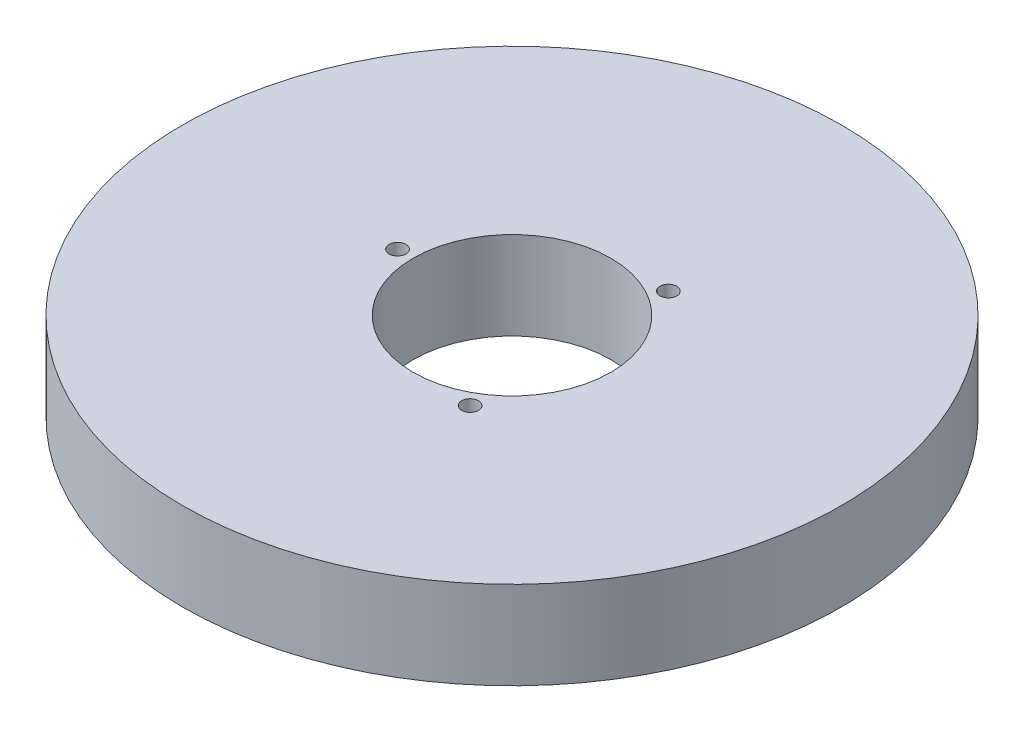
ISO-10303-21;
HEADER;
FILE_DESCRIPTION(('STEP AP214'),'2;1');
FILE_NAME('part.step','',(''),(''),'','','');
FILE_SCHEMA(('AUTOMOTIVE_DESIGN { 1 0 10303 214 1 1 1 1 }'));
ENDSEC;
DATA;
#1=APPLICATION_CONTEXT('core data for automotive mechanical design processes');
#2=APPLICATION_PROTOCOL_DEFINITION('international standard','automotive_design',2000,#1);
#3=PRODUCT_CONTEXT('',#1,'mechanical');
#4=PRODUCT('Part','Part','',(#3));
#5=PRODUCT_RELATED_PRODUCT_CATEGORY('part','',(#4));
#6=PRODUCT_DEFINITION_FORMATION('','',#4);
#7=PRODUCT_DEFINITION_CONTEXT('part definition',#1,'design');
#8=PRODUCT_DEFINITION('design','',#6,#7);
#9=PRODUCT_DEFINITION_SHAPE('','',#8);
#10=(LENGTH_UNIT() NAMED_UNIT(*) SI_UNIT(.MILLI.,.METRE.));
#11=(NAMED_UNIT(*) PLANE_ANGLE_UNIT() SI_UNIT($,.RADIAN.));
#12=(NAMED_UNIT(*) SI_UNIT($,.STERADIAN.) SOLID_ANGLE_UNIT());
#13=UNCERTAINTY_MEASURE_WITH_UNIT(LENGTH_MEASURE(1.E-05),#10,'distance_accuracy_value','');
#14=(GEOMETRIC_REPRESENTATION_CONTEXT(3) GLOBAL_UNCERTAINTY_ASSIGNED_CONTEXT((#13)) GLOBAL_UNIT_ASSIGNED_CONTEXT((#10,
#11,#12)) REPRESENTATION_CONTEXT('',''));
#15=CARTESIAN_POINT('',(0.,0.,0.));
#16=DIRECTION('',(0.,0.,1.));
#17=DIRECTION('',(1.,0.,0.));
#18=AXIS2_PLACEMENT_3D('',#15,#16,#17);
#19=CARTESIAN_POINT('',(0.,20.,0.));
#20=DIRECTION('',(0.,-1.,0.));
#21=DIRECTION('',(0.,0.,-1.));
#22=AXIS2_PLACEMENT_3D('',#19,#20,#21);
#23=CYLINDRICAL_SURFACE('',#22,75.);
#24=CARTESIAN_POINT('',(0.,20.,0.));
#25=DIRECTION('',(0.,1.,0.));
#26=DIRECTION('',(0.,0.,1.));
#27=AXIS2_PLACEMENT_3D('',#24,#25,#26);
#28=CIRCLE('',#27,75.);
#29=CARTESIAN_POINT('',(0.,20.,75.));
#30=VERTEX_POINT('',#29);
#31=EDGE_CURVE('E10',#30,#30,#28,.T.);
#32=ORIENTED_EDGE('',*,*,#31,.F.);
#33=EDGE_LOOP('',(#32));
#34=FACE_BOUND('',#33,.T.);
#35=CARTESIAN_POINT('',(0.,0.,0.));
#36=DIRECTION('',(0.,1.,0.));
#37=DIRECTION('',(0.,0.,1.));
#38=AXIS2_PLACEMENT_3D('',#35,#36,#37);
#39=CIRCLE('',#38,75.);
#40=CARTESIAN_POINT('',(0.,0.,75.));
#41=VERTEX_POINT('',#40);
#42=EDGE_CURVE('E37',#41,#41,#39,.T.);
#43=ORIENTED_EDGE('',*,*,#42,.T.);
#44=EDGE_LOOP('',(#43));
#45=FACE_BOUND('',#44,.T.);
#46=ADVANCED_FACE('F40',(#34,#45),#23,.T.);
#47=CARTESIAN_POINT('',(0.,20.,0.));
#48=DIRECTION('',(0.,1.,0.));
#49=DIRECTION('',(0.,0.,1.));
#50=AXIS2_PLACEMENT_3D('',#47,#48,#49);
#51=PLANE('',#50);
#52=CARTESIAN_POINT('',(13.0265786434046,20.,22.5626960591681));
#53=DIRECTION('',(0.,1.,0.));
#54=DIRECTION('',(0.866025403784436,0.,-0.500000000000004));
#55=AXIS2_PLACEMENT_3D('',#52,#53,#54);
#56=CIRCLE('',#55,1.90919716067538);
#57=CARTESIAN_POINT('',(14.6799918853826,20.,21.6080974788304));
#58=VERTEX_POINT('',#57);
#59=EDGE_CURVE('E70',#58,#58,#56,.T.);
#60=ORIENTED_EDGE('',*,*,#59,.F.);
#61=EDGE_LOOP('',(#60));
#62=FACE_BOUND('',#61,.T.);
#63=CARTESIAN_POINT('',(13.0265786434042,20.,-22.5626960591683));
#64=DIRECTION('',(0.,1.,0.));
#65=DIRECTION('',(-0.866025403784443,0.,-0.499999999999992));
#66=AXIS2_PLACEMENT_3D('',#63,#64,#65);
#67=CIRCLE('',#66,1.90919716067538);
#68=CARTESIAN_POINT('',(11.3731654014262,20.,-23.517294639506));
#69=VERTEX_POINT('',#68);
#70=EDGE_CURVE('E61',#69,#69,#67,.T.);
#71=ORIENTED_EDGE('',*,*,#70,.F.);
#72=EDGE_LOOP('',(#71));
#73=FACE_BOUND('',#72,.T.);
#74=CARTESIAN_POINT('',(-26.0531572868089,20.,0.));
#75=DIRECTION('',(0.,1.,0.));
#76=DIRECTION('',(0.,0.,1.));
#77=AXIS2_PLACEMENT_3D('',#74,#75,#76);
#78=CIRCLE('',#77,1.90919716067538);
#79=CARTESIAN_POINT('',(-26.0531572868089,20.,1.90919716067538));
#80=VERTEX_POINT('',#79);
#81=EDGE_CURVE('E54',#80,#80,#78,.T.);
#82=ORIENTED_EDGE('',*,*,#81,.F.);
#83=EDGE_LOOP('',(#82));
#84=FACE_BOUND('',#83,.T.);
#85=CARTESIAN_POINT('',(0.,20.,0.));
#86=DIRECTION('',(0.,1.,0.));
#87=DIRECTION('',(0.,0.,1.));
#88=AXIS2_PLACEMENT_3D('',#85,#86,#87);
#89=CIRCLE('',#88,22.5);
#90=CARTESIAN_POINT('',(0.,20.,22.5));
#91=VERTEX_POINT('',#90);
#92=EDGE_CURVE('E50',#91,#91,#89,.T.);
#93=ORIENTED_EDGE('',*,*,#92,.F.);
#94=EDGE_LOOP('',(#93));
#95=FACE_BOUND('',#94,.T.);
#96=ORIENTED_EDGE('',*,*,#31,.T.);
#97=EDGE_LOOP('',(#96));
#98=FACE_BOUND('',#97,.T.);
#99=ADVANCED_FACE('F85',(#62,#73,#84,#95,#98),#51,.T.);
#100=CARTESIAN_POINT('',(0.,0.,0.));
#101=DIRECTION('',(0.,1.,0.));
#102=DIRECTION('',(0.,0.,1.));
#103=AXIS2_PLACEMENT_3D('',#100,#101,#102);
#104=PLANE('',#103);
#105=CARTESIAN_POINT('',(0.,0.,0.));
#106=DIRECTION('',(0.,1.,0.));
#107=DIRECTION('',(0.,0.,1.));
#108=AXIS2_PLACEMENT_3D('',#105,#106,#107);
#109=CIRCLE('',#108,22.5);
#110=CARTESIAN_POINT('',(0.,0.,22.5));
#111=VERTEX_POINT('',#110);
#112=EDGE_CURVE('E47',#111,#111,#109,.T.);
#113=ORIENTED_EDGE('',*,*,#112,.T.);
#114=EDGE_LOOP('',(#113));
#115=FACE_BOUND('',#114,.T.);
#116=ORIENTED_EDGE('',*,*,#42,.F.);
#117=EDGE_LOOP('',(#116));
#118=FACE_BOUND('',#117,.T.);
#119=ADVANCED_FACE('F84',(#115,#118),#104,.F.);
#120=CARTESIAN_POINT('',(0.,20.,0.));
#121=DIRECTION('',(0.,-1.,0.));
#122=DIRECTION('',(0.,0.,-1.));
#123=AXIS2_PLACEMENT_3D('',#120,#121,#122);
#124=CYLINDRICAL_SURFACE('',#123,22.5);
#125=ORIENTED_EDGE('',*,*,#92,.T.);
#126=EDGE_LOOP('',(#125));
#127=FACE_BOUND('',#126,.T.);
#128=ORIENTED_EDGE('',*,*,#112,.F.);
#129=EDGE_LOOP('',(#128));
#130=FACE_BOUND('',#129,.T.);
#131=ADVANCED_FACE('F91',(#127,#130),#124,.F.);
#132=CARTESIAN_POINT('',(-26.0531572868089,1.8096753145772,0.));
#133=DIRECTION('',(0.,1.,0.));
#134=DIRECTION('',(0.,0.,1.));
#135=AXIS2_PLACEMENT_3D('',#132,#133,#134);
#136=CYLINDRICAL_SURFACE('',#135,1.90919716067538);
#137=CARTESIAN_POINT('',(-26.0531572868089,1.8096753145772,0.));
#138=DIRECTION('',(0.,1.,0.));
#139=DIRECTION('',(0.,0.,1.));
#140=AXIS2_PLACEMENT_3D('',#137,#138,#139);
#141=CIRCLE('',#140,1.90919716067538);
#142=CARTESIAN_POINT('',(-26.0531572868089,1.8096753145772,1.90919716067538));
#143=VERTEX_POINT('',#142);
#144=EDGE_CURVE('E55',#143,#143,#141,.T.);
#145=ORIENTED_EDGE('',*,*,#144,.F.);
#146=EDGE_LOOP('',(#145));
#147=FACE_BOUND('',#146,.T.);
#148=ORIENTED_EDGE('',*,*,#81,.T.);
#149=EDGE_LOOP('',(#148));
#150=FACE_BOUND('',#149,.T.);
#151=ADVANCED_FACE('F96',(#147,#150),#136,.F.);
#152=CARTESIAN_POINT('',(-26.0531572868089,1.8096753145772,0.));
#153=DIRECTION('',(0.,1.,0.));
#154=DIRECTION('',(0.,0.,1.));
#155=AXIS2_PLACEMENT_3D('',#152,#153,#154);
#156=PLANE('',#155);
#157=ORIENTED_EDGE('',*,*,#144,.T.);
#158=EDGE_LOOP('',(#157));
#159=FACE_BOUND('',#158,.T.);
#160=ADVANCED_FACE('F127',(#159),#156,.T.);
#161=CARTESIAN_POINT('',(13.0265786434042,1.8096753145772,-22.5626960591683));
#162=DIRECTION('',(0.,1.,0.));
#163=DIRECTION('',(0.,0.,1.));
#164=AXIS2_PLACEMENT_3D('',#161,#162,#163);
#165=CYLINDRICAL_SURFACE('',#164,1.90919716067538);
#166=CARTESIAN_POINT('',(13.0265786434042,1.8096753145772,-22.5626960591683));
#167=DIRECTION('',(0.,1.,0.));
#168=DIRECTION('',(-0.866025403784443,0.,-0.499999999999992));
#169=AXIS2_PLACEMENT_3D('',#166,#167,#168);
#170=CIRCLE('',#169,1.90919716067538);
#171=CARTESIAN_POINT('',(11.3731654014262,1.8096753145772,-23.517294639506));
#172=VERTEX_POINT('',#171);
#173=EDGE_CURVE('E63',#172,#172,#170,.T.);
#174=ORIENTED_EDGE('',*,*,#173,.F.);
#175=EDGE_LOOP('',(#174));
#176=FACE_BOUND('',#175,.T.);
#177=ORIENTED_EDGE('',*,*,#70,.T.);
#178=EDGE_LOOP('',(#177));
#179=FACE_BOUND('',#178,.T.);
#180=ADVANCED_FACE('F133',(#176,#179),#165,.F.);
#181=CARTESIAN_POINT('',(13.0265786434042,1.8096753145772,-22.5626960591683));
#182=DIRECTION('',(0.,1.,0.));
#183=DIRECTION('',(-0.866025403784443,0.,-0.499999999999992));
#184=AXIS2_PLACEMENT_3D('',#181,#182,#183);
#185=PLANE('',#184);
#186=ORIENTED_EDGE('',*,*,#173,.T.);
#187=EDGE_LOOP('',(#186));
#188=FACE_BOUND('',#187,.T.);
#189=ADVANCED_FACE('F77',(#188),#185,.T.);
#190=CARTESIAN_POINT('',(13.0265786434046,1.8096753145772,22.5626960591681));
#191=DIRECTION('',(0.,1.,0.));
#192=DIRECTION('',(0.,0.,1.));
#193=AXIS2_PLACEMENT_3D('',#190,#191,#192);
#194=CYLINDRICAL_SURFACE('',#193,1.90919716067538);
#195=CARTESIAN_POINT('',(13.0265786434046,1.8096753145772,22.5626960591681));
#196=DIRECTION('',(0.,1.,0.));
#197=DIRECTION('',(0.866025403784436,0.,-0.500000000000004));
#198=AXIS2_PLACEMENT_3D('',#195,#196,#197);
#199=CIRCLE('',#198,1.90919716067538);
#200=CARTESIAN_POINT('',(14.6799918853826,1.8096753145772,21.6080974788304));
#201=VERTEX_POINT('',#200);
#202=EDGE_CURVE('E59',#201,#201,#199,.T.);
#203=ORIENTED_EDGE('',*,*,#202,.F.);
#204=EDGE_LOOP('',(#203));
#205=FACE_BOUND('',#204,.T.);
#206=ORIENTED_EDGE('',*,*,#59,.T.);
#207=EDGE_LOOP('',(#206));
#208=FACE_BOUND('',#207,.T.);
#209=ADVANCED_FACE('F73',(#205,#208),#194,.F.);
#210=CARTESIAN_POINT('',(13.0265786434046,1.8096753145772,22.5626960591681));
#211=DIRECTION('',(0.,1.,0.));
#212=DIRECTION('',(0.866025403784436,0.,-0.500000000000004));
#213=AXIS2_PLACEMENT_3D('',#210,#211,#212);
#214=PLANE('',#213);
#215=ORIENTED_EDGE('',*,*,#202,.T.);
#216=EDGE_LOOP('',(#215));
#217=FACE_BOUND('',#216,.T.);
#218=ADVANCED_FACE('F71',(#217),#214,.T.);
#219=CLOSED_SHELL('',(#46,#99,#119,#131,#151,#160,#180,#189,#209,#218));
#220=MANIFOLD_SOLID_BREP('B2',#219);
#221=ADVANCED_BREP_SHAPE_REPRESENTATION('',(#18,#220),#14);
#222=SHAPE_DEFINITION_REPRESENTATION(#9,#221);
ENDSEC;
END-ISO-10303-21;
